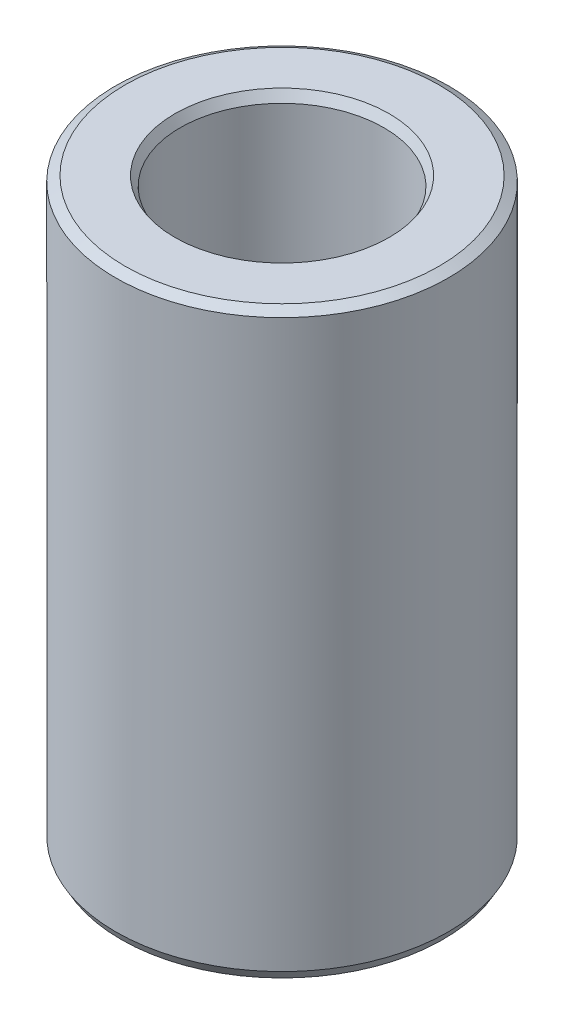
ISO-10303-21;
HEADER;
FILE_DESCRIPTION(('STEP AP214'),'2;1');
FILE_NAME('part.step','',(''),(''),'','','');
FILE_SCHEMA(('AUTOMOTIVE_DESIGN { 1 0 10303 214 1 1 1 1 }'));
ENDSEC;
DATA;
#1=APPLICATION_CONTEXT('core data for automotive mechanical design processes');
#2=APPLICATION_PROTOCOL_DEFINITION('international standard','automotive_design',2000,#1);
#3=PRODUCT_CONTEXT('',#1,'mechanical');
#4=PRODUCT('Part','Part','',(#3));
#5=PRODUCT_RELATED_PRODUCT_CATEGORY('part','',(#4));
#6=PRODUCT_DEFINITION_FORMATION('','',#4);
#7=PRODUCT_DEFINITION_CONTEXT('part definition',#1,'design');
#8=PRODUCT_DEFINITION('design','',#6,#7);
#9=PRODUCT_DEFINITION_SHAPE('','',#8);
#10=(LENGTH_UNIT() NAMED_UNIT(*) SI_UNIT(.MILLI.,.METRE.));
#11=(NAMED_UNIT(*) PLANE_ANGLE_UNIT() SI_UNIT($,.RADIAN.));
#12=(NAMED_UNIT(*) SI_UNIT($,.STERADIAN.) SOLID_ANGLE_UNIT());
#13=UNCERTAINTY_MEASURE_WITH_UNIT(LENGTH_MEASURE(1.E-05),#10,'distance_accuracy_value','');
#14=(GEOMETRIC_REPRESENTATION_CONTEXT(3) GLOBAL_UNCERTAINTY_ASSIGNED_CONTEXT((#13)) GLOBAL_UNIT_ASSIGNED_CONTEXT((#10,
#11,#12)) REPRESENTATION_CONTEXT('',''));
#15=CARTESIAN_POINT('',(0.,0.,0.));
#16=DIRECTION('',(0.,0.,1.));
#17=DIRECTION('',(1.,0.,0.));
#18=AXIS2_PLACEMENT_3D('',#15,#16,#17);
#19=CARTESIAN_POINT('',(0.,157.133923063108,0.));
#20=DIRECTION('',(0.,-1.,0.));
#21=DIRECTION('',(0.,0.,-1.));
#22=AXIS2_PLACEMENT_3D('',#19,#20,#21);
#23=CYLINDRICAL_SURFACE('',#22,45.);
#24=CARTESIAN_POINT('',(0.,2.53364364221362,0.));
#25=DIRECTION('',(0.,1.,0.));
#26=DIRECTION('',(0.,0.,1.));
#27=AXIS2_PLACEMENT_3D('',#24,#25,#26);
#28=CIRCLE('',#27,45.);
#29=CARTESIAN_POINT('',(0.,2.53364364221362,45.));
#30=VERTEX_POINT('',#29);
#31=EDGE_CURVE('E10',#30,#30,#28,.T.);
#32=ORIENTED_EDGE('',*,*,#31,.T.);
#33=EDGE_LOOP('',(#32));
#34=FACE_BOUND('',#33,.T.);
#35=CARTESIAN_POINT('',(0.,155.671123224245,0.));
#36=DIRECTION('',(0.,1.,0.));
#37=DIRECTION('',(0.,0.,1.));
#38=AXIS2_PLACEMENT_3D('',#35,#36,#37);
#39=CIRCLE('',#38,45.);
#40=CARTESIAN_POINT('',(0.,155.671123224245,-45.));
#41=VERTEX_POINT('',#40);
#42=EDGE_CURVE('E50',#41,#41,#39,.F.);
#43=ORIENTED_EDGE('',*,*,#42,.T.);
#44=EDGE_LOOP('',(#43));
#45=FACE_BOUND('',#44,.T.);
#46=ADVANCED_FACE('F39',(#34,#45),#23,.T.);
#47=CARTESIAN_POINT('',(0.,157.133923063108,0.));
#48=DIRECTION('',(0.,1.,0.));
#49=DIRECTION('',(0.,0.,1.));
#50=AXIS2_PLACEMENT_3D('',#47,#48,#49);
#51=PLANE('',#50);
#52=CARTESIAN_POINT('',(0.,157.133923063108,0.));
#53=DIRECTION('',(0.,1.,0.));
#54=DIRECTION('',(0.,0.,1.));
#55=AXIS2_PLACEMENT_3D('',#52,#53,#54);
#56=CIRCLE('',#55,28.9867455116761);
#57=CARTESIAN_POINT('',(0.,157.133923063108,28.9867455116761));
#58=VERTEX_POINT('',#57);
#59=EDGE_CURVE('E58',#58,#58,#56,.F.);
#60=ORIENTED_EDGE('',*,*,#59,.T.);
#61=EDGE_LOOP('',(#60));
#62=FACE_BOUND('',#61,.T.);
#63=CARTESIAN_POINT('',(0.,157.133923063108,0.));
#64=DIRECTION('',(0.,1.,0.));
#65=DIRECTION('',(0.,0.,1.));
#66=AXIS2_PLACEMENT_3D('',#63,#64,#65);
#67=CIRCLE('',#66,42.4663563577865);
#68=CARTESIAN_POINT('',(0.,157.133923063108,-42.4663563577865));
#69=VERTEX_POINT('',#68);
#70=EDGE_CURVE('E61',#69,#69,#67,.T.);
#71=ORIENTED_EDGE('',*,*,#70,.T.);
#72=EDGE_LOOP('',(#71));
#73=FACE_BOUND('',#72,.T.);
#74=ADVANCED_FACE('F88',(#62,#73),#51,.T.);
#75=CARTESIAN_POINT('',(0.,0.,0.));
#76=DIRECTION('',(0.,1.,0.));
#77=DIRECTION('',(0.,0.,1.));
#78=AXIS2_PLACEMENT_3D('',#75,#76,#77);
#79=PLANE('',#78);
#80=CARTESIAN_POINT('',(0.,0.,0.));
#81=DIRECTION('',(0.,1.,0.));
#82=DIRECTION('',(0.,0.,1.));
#83=AXIS2_PLACEMENT_3D('',#80,#81,#82);
#84=CIRCLE('',#83,30.0575893150271);
#85=CARTESIAN_POINT('',(0.,0.,-30.0575893150271));
#86=VERTEX_POINT('',#85);
#87=EDGE_CURVE('E51',#86,#86,#84,.T.);
#88=ORIENTED_EDGE('',*,*,#87,.T.);
#89=EDGE_LOOP('',(#88));
#90=FACE_BOUND('',#89,.T.);
#91=CARTESIAN_POINT('',(0.,0.,0.));
#92=DIRECTION('',(0.,1.,0.));
#93=DIRECTION('',(0.,0.,1.));
#94=AXIS2_PLACEMENT_3D('',#91,#92,#93);
#95=CIRCLE('',#94,43.5372001611374);
#96=CARTESIAN_POINT('',(0.,0.,43.5372001611374));
#97=VERTEX_POINT('',#96);
#98=EDGE_CURVE('E54',#97,#97,#95,.F.);
#99=ORIENTED_EDGE('',*,*,#98,.T.);
#100=EDGE_LOOP('',(#99));
#101=FACE_BOUND('',#100,.T.);
#102=ADVANCED_FACE('F83',(#90,#101),#79,.F.);
#103=CARTESIAN_POINT('',(0.,157.133923063108,0.));
#104=DIRECTION('',(0.,-1.,0.));
#105=DIRECTION('',(0.,0.,-1.));
#106=AXIS2_PLACEMENT_3D('',#103,#104,#105);
#107=CYLINDRICAL_SURFACE('',#106,27.5239456728135);
#108=CARTESIAN_POINT('',(0.,154.600279420894,0.));
#109=DIRECTION('',(0.,1.,0.));
#110=DIRECTION('',(0.,0.,1.));
#111=AXIS2_PLACEMENT_3D('',#108,#109,#110);
#112=CIRCLE('',#111,27.5239456728135);
#113=CARTESIAN_POINT('',(0.,154.600279420894,27.5239456728135));
#114=VERTEX_POINT('',#113);
#115=EDGE_CURVE('E67',#114,#114,#112,.T.);
#116=ORIENTED_EDGE('',*,*,#115,.T.);
#117=EDGE_LOOP('',(#116));
#118=FACE_BOUND('',#117,.T.);
#119=CARTESIAN_POINT('',(0.,1.46279983886261,0.));
#120=DIRECTION('',(0.,1.,0.));
#121=DIRECTION('',(0.,0.,1.));
#122=AXIS2_PLACEMENT_3D('',#119,#120,#121);
#123=CIRCLE('',#122,27.5239456728135);
#124=CARTESIAN_POINT('',(0.,1.4627998388626,-27.5239456728135));
#125=VERTEX_POINT('',#124);
#126=EDGE_CURVE('E69',#125,#125,#123,.F.);
#127=ORIENTED_EDGE('',*,*,#126,.T.);
#128=EDGE_LOOP('',(#127));
#129=FACE_BOUND('',#128,.T.);
#130=ADVANCED_FACE('F71',(#118,#129),#107,.F.);
#131=CARTESIAN_POINT('',(0.,154.600279420894,0.));
#132=DIRECTION('',(0.,1.,0.));
#133=DIRECTION('',(0.,0.,1.));
#134=AXIS2_PLACEMENT_3D('',#131,#132,#133);
#135=CONICAL_SURFACE('',#134,27.5239456728135,0.523598775598294);
#136=ORIENTED_EDGE('',*,*,#59,.F.);
#137=EDGE_LOOP('',(#136));
#138=FACE_BOUND('',#137,.T.);
#139=ORIENTED_EDGE('',*,*,#115,.F.);
#140=EDGE_LOOP('',(#139));
#141=FACE_BOUND('',#140,.T.);
#142=ADVANCED_FACE('F77',(#138,#141),#135,.F.);
#143=CARTESIAN_POINT('',(0.,0.,0.));
#144=DIRECTION('',(0.,-1.,0.));
#145=DIRECTION('',(0.,0.,-1.));
#146=AXIS2_PLACEMENT_3D('',#143,#144,#145);
#147=CONICAL_SURFACE('',#146,30.0575893150271,1.04719755119659);
#148=CARTESIAN_POINT('',(0.,1.4627998388626,-27.5239456728135));
#149=CARTESIAN_POINT('',(0.,1.44756234054112,-27.5503377940866));
#150=CARTESIAN_POINT('',(0.,1.43232484221963,-27.5767299153596));
#151=CARTESIAN_POINT('',(0.,1.40184984557666,-27.6295141579057));
#152=CARTESIAN_POINT('',(0.,1.38661234725518,-27.6559062791788));
#153=CARTESIAN_POINT('',(0.,1.35613735061221,-27.7086905217249));
#154=CARTESIAN_POINT('',(0.,1.34089985229072,-27.735082642998));
#155=CARTESIAN_POINT('',(0.,1.31042485564775,-27.7878668855441));
#156=CARTESIAN_POINT('',(0.,1.29518735732626,-27.8142590068171));
#157=CARTESIAN_POINT('',(0.,1.26471236068329,-27.8670432493633));
#158=CARTESIAN_POINT('',(0.,1.24947486236181,-27.8934353706363));
#159=CARTESIAN_POINT('',(0.,1.21899986571884,-27.9462196131824));
#160=CARTESIAN_POINT('',(0.,1.20376236739735,-27.9726117344555));
#161=CARTESIAN_POINT('',(0.,1.17328737075438,-28.0253959770016));
#162=CARTESIAN_POINT('',(0.,1.1580498724329,-28.0517880982747));
#163=CARTESIAN_POINT('',(0.,1.12757487578992,-28.1045723408208));
#164=CARTESIAN_POINT('',(0.,1.11233737746844,-28.1309644620938));
#165=CARTESIAN_POINT('',(0.,1.08186238082547,-28.18374870464));
#166=CARTESIAN_POINT('',(0.,1.06662488250398,-28.210140825913));
#167=CARTESIAN_POINT('',(0.,1.03614988586101,-28.2629250684591));
#168=CARTESIAN_POINT('',(0.,1.02091238753953,-28.2893171897322));
#169=CARTESIAN_POINT('',(0.,0.990437390896555,-28.3421014322783));
#170=CARTESIAN_POINT('',(0.,0.97519989257507,-28.3684935535514));
#171=CARTESIAN_POINT('',(0.,0.944724895932099,-28.4212777960975));
#172=CARTESIAN_POINT('',(0.,0.929487397610614,-28.4476699173705));
#173=CARTESIAN_POINT('',(0.,0.899012400967643,-28.5004541599167));
#174=CARTESIAN_POINT('',(0.,0.883774902646157,-28.5268462811897));
#175=CARTESIAN_POINT('',(0.,0.853299906003186,-28.5796305237358));
#176=CARTESIAN_POINT('',(0.,0.8380624076817,-28.6060226450089));
#177=CARTESIAN_POINT('',(0.,0.80758741103873,-28.658806887555));
#178=CARTESIAN_POINT('',(0.,0.792349912717244,-28.6851990088281));
#179=CARTESIAN_POINT('',(0.,0.761874916074274,-28.7379832513742));
#180=CARTESIAN_POINT('',(0.,0.746637417752788,-28.7643753726472));
#181=CARTESIAN_POINT('',(0.,0.716162421109817,-28.8171596151934));
#182=CARTESIAN_POINT('',(0.,0.700924922788331,-28.8435517364664));
#183=CARTESIAN_POINT('',(0.,0.67044992614536,-28.8963359790125));
#184=CARTESIAN_POINT('',(0.,0.655212427823875,-28.9227281002856));
#185=CARTESIAN_POINT('',(0.,0.624737431180904,-28.9755123428317));
#186=CARTESIAN_POINT('',(0.,0.609499932859419,-29.0019044641048));
#187=CARTESIAN_POINT('',(0.,0.579024936216448,-29.0546887066509));
#188=CARTESIAN_POINT('',(0.,0.563787437894962,-29.0810808279239));
#189=CARTESIAN_POINT('',(0.,0.533312441251991,-29.13386507047));
#190=CARTESIAN_POINT('',(0.,0.518074942930506,-29.1602571917431));
#191=CARTESIAN_POINT('',(0.,0.487599946287535,-29.2130414342892));
#192=CARTESIAN_POINT('',(0.,0.47236244796605,-29.2394335555623));
#193=CARTESIAN_POINT('',(0.,0.441887451323079,-29.2922177981084));
#194=CARTESIAN_POINT('',(0.,0.426649953001593,-29.3186099193815));
#195=CARTESIAN_POINT('',(0.,0.396174956358622,-29.3713941619276));
#196=CARTESIAN_POINT('',(0.,0.380937458037136,-29.3977862832006));
#197=CARTESIAN_POINT('',(0.,0.350462461394166,-29.4505705257467));
#198=CARTESIAN_POINT('',(0.,0.33522496307268,-29.4769626470198));
#199=CARTESIAN_POINT('',(0.,0.30474996642971,-29.5297468895659));
#200=CARTESIAN_POINT('',(0.,0.289512468108224,-29.556139010839));
#201=CARTESIAN_POINT('',(0.,0.259037471465253,-29.6089232533851));
#202=CARTESIAN_POINT('',(0.,0.243799973143767,-29.6353153746582));
#203=CARTESIAN_POINT('',(0.,0.213324976500796,-29.6880996172043));
#204=CARTESIAN_POINT('',(0.,0.198087478179311,-29.7144917384773));
#205=CARTESIAN_POINT('',(0.,0.16761248153634,-29.7672759810234));
#206=CARTESIAN_POINT('',(0.,0.152374983214855,-29.7936681022965));
#207=CARTESIAN_POINT('',(0.,0.121899986571884,-29.8464523448426));
#208=CARTESIAN_POINT('',(0.,0.106662488250398,-29.8728444661157));
#209=CARTESIAN_POINT('',(0.,0.0761874916074271,-29.9256287086618));
#210=CARTESIAN_POINT('',(0.,0.0609499932859419,-29.9520208299348));
#211=CARTESIAN_POINT('',(0.,0.0304749966429714,-30.004805072481));
#212=CARTESIAN_POINT('',(0.,0.0152374983214862,-30.031197193754));
#213=CARTESIAN_POINT('',(0.,0.,-30.0575893150271));
#214=B_SPLINE_CURVE_WITH_KNOTS('',3,(#148,#149,#150,#151,#152,#153,#154,#155,#156,#157,#158,
#159,#160,#161,#162,#163,#164,#165,#166,#167,#168,#169,#170,#171,#172,#173,#174,#175,#176,#177,
#178,#179,#180,#181,#182,#183,#184,#185,#186,#187,#188,#189,#190,#191,#192,#193,#194,#195,#196,
#197,#198,#199,#200,#201,#202,#203,#204,#205,#206,#207,#208,#209,#210,#211,#212,#213),
.UNSPECIFIED.,.F.,.F.,(4,2,2,2,2,2,2,2,2,2,2,2,2,2,2,2,2,2,2,2,2,2,2,2,2,2,2,2,2,2,2,2,4),(0.,
0.0914249899289111,0.182849979857825,0.274274969786736,0.365699959715647,0.457124949644562,
0.548549939573473,0.639974929502384,0.731399919431298,0.822824909360209,0.91424989928912,
1.00567488921803,1.09709987914695,1.18852486907586,1.27994985900477,1.37137484893368,
1.46279983886259,1.5542248287915,1.64564981872042,1.73707480864933,1.82849979857824,
1.91992478850715,2.01134977843606,2.10277476836498,2.19419975829389,2.2856247482228,
2.37704973815171,2.46847472808062,2.55989971800954,2.65132470793845,2.74274969786736,
2.83417468779627,2.92559967772518),.UNSPECIFIED.);
#215=EDGE_CURVE('BSEAM73',#125,#86,#214,.T.);
#216=ORIENTED_EDGE('',*,*,#126,.F.);
#217=ORIENTED_EDGE('',*,*,#87,.F.);
#218=ORIENTED_EDGE('',*,*,#215,.T.);
#219=ORIENTED_EDGE('',*,*,#215,.F.);
#220=EDGE_LOOP('',(#216,#218,#217,#219));
#221=FACE_BOUND('',#220,.T.);
#222=ADVANCED_FACE('F73',(#221),#147,.F.);
#223=CARTESIAN_POINT('',(0.,2.53364364221362,0.));
#224=DIRECTION('',(0.,1.,0.));
#225=DIRECTION('',(0.,0.,1.));
#226=AXIS2_PLACEMENT_3D('',#223,#224,#225);
#227=CONICAL_SURFACE('',#226,45.,0.523598775598304);
#228=ORIENTED_EDGE('',*,*,#98,.F.);
#229=EDGE_LOOP('',(#228));
#230=FACE_BOUND('',#229,.T.);
#231=ORIENTED_EDGE('',*,*,#31,.F.);
#232=EDGE_LOOP('',(#231));
#233=FACE_BOUND('',#232,.T.);
#234=ADVANCED_FACE('F76',(#230,#233),#227,.T.);
#235=CARTESIAN_POINT('',(0.,157.133923063108,0.));
#236=DIRECTION('',(0.,-1.,0.));
#237=DIRECTION('',(0.,0.,-1.));
#238=AXIS2_PLACEMENT_3D('',#235,#236,#237);
#239=CONICAL_SURFACE('',#238,42.4663563577865,1.0471975511966);
#240=CARTESIAN_POINT('',(0.,155.671123224245,-45.));
#241=CARTESIAN_POINT('',(0.,155.686360722566,-44.973607878727));
#242=CARTESIAN_POINT('',(0.,155.701598220888,-44.9472157574539));
#243=CARTESIAN_POINT('',(0.,155.732073217531,-44.8944315149078));
#244=CARTESIAN_POINT('',(0.,155.747310715852,-44.8680393936347));
#245=CARTESIAN_POINT('',(0.,155.777785712495,-44.8152551510886));
#246=CARTESIAN_POINT('',(0.,155.793023210817,-44.7888630298156));
#247=CARTESIAN_POINT('',(0.,155.82349820746,-44.7360787872694));
#248=CARTESIAN_POINT('',(0.,155.838735705781,-44.7096866659964));
#249=CARTESIAN_POINT('',(0.,155.869210702424,-44.6569024234503));
#250=CARTESIAN_POINT('',(0.,155.884448200746,-44.6305103021772));
#251=CARTESIAN_POINT('',(0.,155.914923197389,-44.5777260596311));
#252=CARTESIAN_POINT('',(0.,155.93016069571,-44.551333938358));
#253=CARTESIAN_POINT('',(0.,155.960635692353,-44.4985496958119));
#254=CARTESIAN_POINT('',(0.,155.975873190675,-44.4721575745389));
#255=CARTESIAN_POINT('',(0.,156.006348187318,-44.4193733319928));
#256=CARTESIAN_POINT('',(0.,156.021585685639,-44.3929812107197));
#257=CARTESIAN_POINT('',(0.,156.052060682282,-44.3401969681736));
#258=CARTESIAN_POINT('',(0.,156.067298180604,-44.3138048469005));
#259=CARTESIAN_POINT('',(0.,156.097773177247,-44.2610206043544));
#260=CARTESIAN_POINT('',(0.,156.113010675568,-44.2346284830814));
#261=CARTESIAN_POINT('',(0.,156.143485672211,-44.1818442405352));
#262=CARTESIAN_POINT('',(0.,156.158723170532,-44.1554521192622));
#263=CARTESIAN_POINT('',(0.,156.189198167175,-44.1026678767161));
#264=CARTESIAN_POINT('',(0.,156.204435665497,-44.076275755443));
#265=CARTESIAN_POINT('',(0.,156.23491066214,-44.0234915128969));
#266=CARTESIAN_POINT('',(0.,156.250148160461,-43.9970993916238));
#267=CARTESIAN_POINT('',(0.,156.280623157104,-43.9443151490777));
#268=CARTESIAN_POINT('',(0.,156.295860655426,-43.9179230278047));
#269=CARTESIAN_POINT('',(0.,156.326335652069,-43.8651387852585));
#270=CARTESIAN_POINT('',(0.,156.34157315039,-43.8387466639855));
#271=CARTESIAN_POINT('',(0.,156.372048147033,-43.7859624214394));
#272=CARTESIAN_POINT('',(0.,156.387285645355,-43.7595703001663));
#273=CARTESIAN_POINT('',(0.,156.417760641998,-43.7067860576202));
#274=CARTESIAN_POINT('',(0.,156.432998140319,-43.6803939363471));
#275=CARTESIAN_POINT('',(0.,156.463473136962,-43.627609693801));
#276=CARTESIAN_POINT('',(0.,156.478710635284,-43.601217572528));
#277=CARTESIAN_POINT('',(0.,156.509185631927,-43.5484333299819));
#278=CARTESIAN_POINT('',(0.,156.524423130248,-43.5220412087088));
#279=CARTESIAN_POINT('',(0.,156.554898126891,-43.4692569661627));
#280=CARTESIAN_POINT('',(0.,156.570135625213,-43.4428648448896));
#281=CARTESIAN_POINT('',(0.,156.600610621856,-43.3900806023435));
#282=CARTESIAN_POINT('',(0.,156.615848120177,-43.3636884810704));
#283=CARTESIAN_POINT('',(0.,156.64632311682,-43.3109042385243));
#284=CARTESIAN_POINT('',(0.,156.661560615141,-43.2845121172513));
#285=CARTESIAN_POINT('',(0.,156.692035611784,-43.2317278747052));
#286=CARTESIAN_POINT('',(0.,156.707273110106,-43.2053357534321));
#287=CARTESIAN_POINT('',(0.,156.737748106749,-43.152551510886));
#288=CARTESIAN_POINT('',(0.,156.75298560507,-43.1261593896129));
#289=CARTESIAN_POINT('',(0.,156.783460601713,-43.0733751470668));
#290=CARTESIAN_POINT('',(0.,156.798698100035,-43.0469830257937));
#291=CARTESIAN_POINT('',(0.,156.829173096678,-42.9941987832476));
#292=CARTESIAN_POINT('',(0.,156.844410594999,-42.9678066619746));
#293=CARTESIAN_POINT('',(0.,156.874885591642,-42.9150224194285));
#294=CARTESIAN_POINT('',(0.,156.890123089964,-42.8886302981554));
#295=CARTESIAN_POINT('',(0.,156.920598086607,-42.8358460556093));
#296=CARTESIAN_POINT('',(0.,156.935835584928,-42.8094539343362));
#297=CARTESIAN_POINT('',(0.,156.966310581571,-42.7566696917901));
#298=CARTESIAN_POINT('',(0.,156.981548079893,-42.7302775705171));
#299=CARTESIAN_POINT('',(0.,157.012023076536,-42.6774933279709));
#300=CARTESIAN_POINT('',(0.,157.027260574857,-42.6511012066979));
#301=CARTESIAN_POINT('',(0.,157.0577355715,-42.5983169641518));
#302=CARTESIAN_POINT('',(0.,157.072973069822,-42.5719248428787));
#303=CARTESIAN_POINT('',(0.,157.103448066465,-42.5191406003326));
#304=CARTESIAN_POINT('',(0.,157.118685564786,-42.4927484790595));
#305=CARTESIAN_POINT('',(0.,157.133923063108,-42.4663563577865));
#306=B_SPLINE_CURVE_WITH_KNOTS('',3,(#240,#241,#242,#243,#244,#245,#246,#247,#248,#249,#250,
#251,#252,#253,#254,#255,#256,#257,#258,#259,#260,#261,#262,#263,#264,#265,#266,#267,#268,#269,
#270,#271,#272,#273,#274,#275,#276,#277,#278,#279,#280,#281,#282,#283,#284,#285,#286,#287,#288,
#289,#290,#291,#292,#293,#294,#295,#296,#297,#298,#299,#300,#301,#302,#303,#304,#305),
.UNSPECIFIED.,.F.,.F.,(4,2,2,2,2,2,2,2,2,2,2,2,2,2,2,2,2,2,2,2,2,2,2,2,2,2,2,2,2,2,2,2,4),(0.,
0.0914249899289167,0.182849979857833,0.274274969786744,0.365699959715661,0.457124949644557,
0.548549939573474,0.639974929502391,0.731399919431302,0.822824909360218,0.914249899289115,
1.00567488921803,1.09709987914695,1.18852486907586,1.27994985900476,1.37137484893367,
1.46279983886259,1.55422482879151,1.64564981872042,1.73707480864932,1.82849979857823,
1.91992478850715,2.01134977843606,2.10277476836496,2.19419975829388,2.28562474822279,
2.3770497381517,2.46847472808062,2.55989971800952,2.65132470793843,2.74274969786735,
2.83417468779626,2.92559967772518),.UNSPECIFIED.);
#307=EDGE_CURVE('BSEAM45',#41,#69,#306,.T.);
#308=ORIENTED_EDGE('',*,*,#42,.F.);
#309=ORIENTED_EDGE('',*,*,#70,.F.);
#310=ORIENTED_EDGE('',*,*,#307,.T.);
#311=ORIENTED_EDGE('',*,*,#307,.F.);
#312=EDGE_LOOP('',(#308,#310,#309,#311));
#313=FACE_BOUND('',#312,.T.);
#314=ADVANCED_FACE('F45',(#313),#239,.T.);
#315=CLOSED_SHELL('',(#46,#74,#102,#130,#142,#222,#234,#314));
#316=MANIFOLD_SOLID_BREP('B2',#315);
#317=ADVANCED_BREP_SHAPE_REPRESENTATION('',(#18,#316),#14);
#318=SHAPE_DEFINITION_REPRESENTATION(#9,#317);
ENDSEC;
END-ISO-10303-21;
